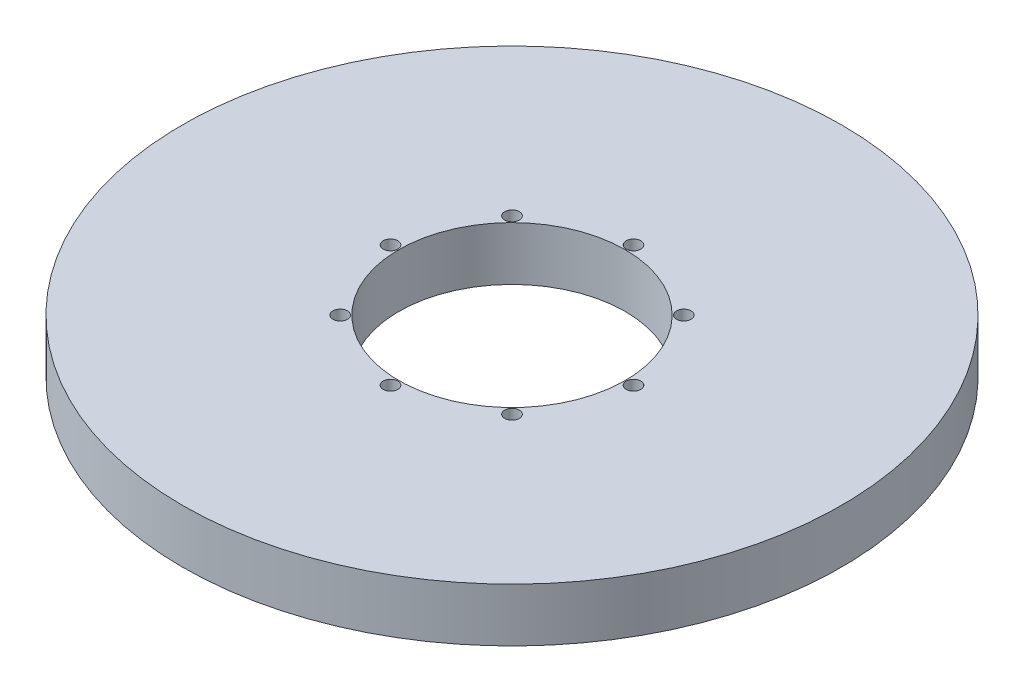
ISO-10303-21;
HEADER;
FILE_DESCRIPTION(('STEP AP214'),'2;1');
FILE_NAME('part.step','',(''),(''),'','','');
FILE_SCHEMA(('AUTOMOTIVE_DESIGN { 1 0 10303 214 1 1 1 1 }'));
ENDSEC;
DATA;
#1=APPLICATION_CONTEXT('core data for automotive mechanical design processes');
#2=APPLICATION_PROTOCOL_DEFINITION('international standard','automotive_design',2000,#1);
#3=PRODUCT_CONTEXT('',#1,'mechanical');
#4=PRODUCT('Part','Part','',(#3));
#5=PRODUCT_RELATED_PRODUCT_CATEGORY('part','',(#4));
#6=PRODUCT_DEFINITION_FORMATION('','',#4);
#7=PRODUCT_DEFINITION_CONTEXT('part definition',#1,'design');
#8=PRODUCT_DEFINITION('design','',#6,#7);
#9=PRODUCT_DEFINITION_SHAPE('','',#8);
#10=(LENGTH_UNIT() NAMED_UNIT(*) SI_UNIT(.MILLI.,.METRE.));
#11=(NAMED_UNIT(*) PLANE_ANGLE_UNIT() SI_UNIT($,.RADIAN.));
#12=(NAMED_UNIT(*) SI_UNIT($,.STERADIAN.) SOLID_ANGLE_UNIT());
#13=UNCERTAINTY_MEASURE_WITH_UNIT(LENGTH_MEASURE(1.E-05),#10,'distance_accuracy_value','');
#14=(GEOMETRIC_REPRESENTATION_CONTEXT(3) GLOBAL_UNCERTAINTY_ASSIGNED_CONTEXT((#13)) GLOBAL_UNIT_ASSIGNED_CONTEXT((#10,
#11,#12)) REPRESENTATION_CONTEXT('',''));
#15=CARTESIAN_POINT('',(0.,0.,0.));
#16=DIRECTION('',(0.,0.,1.));
#17=DIRECTION('',(1.,0.,0.));
#18=AXIS2_PLACEMENT_3D('',#15,#16,#17);
#19=CARTESIAN_POINT('',(0.,13.,0.));
#20=DIRECTION('',(0.,-1.,0.));
#21=DIRECTION('',(0.,0.,-1.));
#22=AXIS2_PLACEMENT_3D('',#19,#20,#21);
#23=CYLINDRICAL_SURFACE('',#22,80.);
#24=CARTESIAN_POINT('',(0.,13.,0.));
#25=DIRECTION('',(0.,1.,0.));
#26=DIRECTION('',(0.,0.,1.));
#27=AXIS2_PLACEMENT_3D('',#24,#25,#26);
#28=CIRCLE('',#27,80.);
#29=CARTESIAN_POINT('',(0.,13.,-80.));
#30=VERTEX_POINT('',#29);
#31=EDGE_CURVE('E10',#30,#30,#28,.T.);
#32=CARTESIAN_POINT('',(0.,0.,0.));
#33=DIRECTION('',(0.,1.,0.));
#34=DIRECTION('',(0.,0.,1.));
#35=AXIS2_PLACEMENT_3D('',#32,#33,#34);
#36=CIRCLE('',#35,80.);
#37=CARTESIAN_POINT('',(0.,0.,-80.));
#38=VERTEX_POINT('',#37);
#39=EDGE_CURVE('E37',#38,#38,#36,.T.);
#40=CARTESIAN_POINT('',(0.,13.,-80.));
#41=CARTESIAN_POINT('',(0.,12.8645833333333,-80.));
#42=CARTESIAN_POINT('',(0.,12.7291666666667,-80.));
#43=CARTESIAN_POINT('',(0.,12.4583333333333,-80.));
#44=CARTESIAN_POINT('',(0.,12.3229166666667,-80.));
#45=CARTESIAN_POINT('',(0.,12.0520833333333,-80.));
#46=CARTESIAN_POINT('',(0.,11.9166666666667,-80.));
#47=CARTESIAN_POINT('',(0.,11.6458333333333,-80.));
#48=CARTESIAN_POINT('',(0.,11.5104166666667,-80.));
#49=CARTESIAN_POINT('',(0.,11.2395833333333,-80.));
#50=CARTESIAN_POINT('',(0.,11.1041666666667,-80.));
#51=CARTESIAN_POINT('',(0.,10.8333333333333,-80.));
#52=CARTESIAN_POINT('',(0.,10.6979166666667,-80.));
#53=CARTESIAN_POINT('',(0.,10.4270833333333,-80.));
#54=CARTESIAN_POINT('',(0.,10.2916666666667,-80.));
#55=CARTESIAN_POINT('',(0.,10.0208333333333,-80.));
#56=CARTESIAN_POINT('',(0.,9.88541666666667,-80.));
#57=CARTESIAN_POINT('',(0.,9.61458333333333,-80.));
#58=CARTESIAN_POINT('',(0.,9.47916666666667,-80.));
#59=CARTESIAN_POINT('',(0.,9.20833333333333,-80.));
#60=CARTESIAN_POINT('',(0.,9.07291666666667,-80.));
#61=CARTESIAN_POINT('',(0.,8.80208333333333,-80.));
#62=CARTESIAN_POINT('',(0.,8.66666666666667,-80.));
#63=CARTESIAN_POINT('',(0.,8.39583333333333,-80.));
#64=CARTESIAN_POINT('',(0.,8.26041666666667,-80.));
#65=CARTESIAN_POINT('',(0.,7.98958333333333,-80.));
#66=CARTESIAN_POINT('',(0.,7.85416666666667,-80.));
#67=CARTESIAN_POINT('',(0.,7.58333333333333,-80.));
#68=CARTESIAN_POINT('',(0.,7.44791666666667,-80.));
#69=CARTESIAN_POINT('',(0.,7.17708333333333,-80.));
#70=CARTESIAN_POINT('',(0.,7.04166666666667,-80.));
#71=CARTESIAN_POINT('',(0.,6.77083333333333,-80.));
#72=CARTESIAN_POINT('',(0.,6.63541666666667,-80.));
#73=CARTESIAN_POINT('',(0.,6.36458333333333,-80.));
#74=CARTESIAN_POINT('',(0.,6.22916666666667,-80.));
#75=CARTESIAN_POINT('',(0.,5.95833333333333,-80.));
#76=CARTESIAN_POINT('',(0.,5.82291666666667,-80.));
#77=CARTESIAN_POINT('',(0.,5.55208333333333,-80.));
#78=CARTESIAN_POINT('',(0.,5.41666666666667,-80.));
#79=CARTESIAN_POINT('',(0.,5.14583333333333,-80.));
#80=CARTESIAN_POINT('',(0.,5.01041666666667,-80.));
#81=CARTESIAN_POINT('',(0.,4.73958333333333,-80.));
#82=CARTESIAN_POINT('',(0.,4.60416666666667,-80.));
#83=CARTESIAN_POINT('',(0.,4.33333333333333,-80.));
#84=CARTESIAN_POINT('',(0.,4.19791666666667,-80.));
#85=CARTESIAN_POINT('',(0.,3.92708333333333,-80.));
#86=CARTESIAN_POINT('',(0.,3.79166666666667,-80.));
#87=CARTESIAN_POINT('',(0.,3.52083333333333,-80.));
#88=CARTESIAN_POINT('',(0.,3.38541666666667,-80.));
#89=CARTESIAN_POINT('',(0.,3.11458333333333,-80.));
#90=CARTESIAN_POINT('',(0.,2.97916666666667,-80.));
#91=CARTESIAN_POINT('',(0.,2.70833333333333,-80.));
#92=CARTESIAN_POINT('',(0.,2.57291666666667,-80.));
#93=CARTESIAN_POINT('',(0.,2.30208333333333,-80.));
#94=CARTESIAN_POINT('',(0.,2.16666666666667,-80.));
#95=CARTESIAN_POINT('',(0.,1.89583333333333,-80.));
#96=CARTESIAN_POINT('',(0.,1.76041666666667,-80.));
#97=CARTESIAN_POINT('',(0.,1.48958333333333,-80.));
#98=CARTESIAN_POINT('',(0.,1.35416666666667,-80.));
#99=CARTESIAN_POINT('',(0.,1.08333333333333,-80.));
#100=CARTESIAN_POINT('',(0.,0.947916666666667,-80.));
#101=CARTESIAN_POINT('',(0.,0.677083333333334,-80.));
#102=CARTESIAN_POINT('',(0.,0.541666666666667,-80.));
#103=CARTESIAN_POINT('',(0.,0.270833333333334,-80.));
#104=CARTESIAN_POINT('',(0.,0.135416666666667,-80.));
#105=CARTESIAN_POINT('',(0.,0.,-80.));
#106=B_SPLINE_CURVE_WITH_KNOTS('',3,(#40,#41,#42,#43,#44,#45,#46,#47,#48,#49,#50,#51,#52,#53,
#54,#55,#56,#57,#58,#59,#60,#61,#62,#63,#64,#65,#66,#67,#68,#69,#70,#71,#72,#73,#74,#75,#76,#77,
#78,#79,#80,#81,#82,#83,#84,#85,#86,#87,#88,#89,#90,#91,#92,#93,#94,#95,#96,#97,#98,#99,#100,
#101,#102,#103,#104,#105),.UNSPECIFIED.,.F.,.F.,(4,2,2,2,2,2,2,2,2,2,2,2,2,2,2,2,2,2,2,2,2,2,2,
2,2,2,2,2,2,2,2,2,4),(0.,0.406249999999999,0.812499999999999,1.21875,1.625,2.03125,2.4375,
2.84375,3.25,3.65625,4.0625,4.46875,4.875,5.28125,5.6875,6.09375,6.5,6.90625,7.3125,7.71875,
8.125,8.53125,8.9375,9.34375,9.75,10.15625,10.5625,10.96875,11.375,11.78125,12.1875,12.59375,
13.),.UNSPECIFIED.);
#107=EDGE_CURVE('BSEAM40',#30,#38,#106,.T.);
#108=ORIENTED_EDGE('',*,*,#31,.F.);
#109=ORIENTED_EDGE('',*,*,#39,.T.);
#110=ORIENTED_EDGE('',*,*,#107,.T.);
#111=ORIENTED_EDGE('',*,*,#107,.F.);
#112=EDGE_LOOP('',(#108,#110,#109,#111));
#113=FACE_BOUND('',#112,.T.);
#114=ADVANCED_FACE('F40',(#113),#23,.T.);
#115=CARTESIAN_POINT('',(0.,13.,0.));
#116=DIRECTION('',(0.,1.,0.));
#117=DIRECTION('',(0.,0.,1.));
#118=AXIS2_PLACEMENT_3D('',#115,#116,#117);
#119=PLANE('',#118);
#120=CARTESIAN_POINT('',(1.0297203090917E-13,13.,29.4923618131921));
#121=DIRECTION('',(0.,1.,0.));
#122=DIRECTION('',(1.,0.,0.));
#123=AXIS2_PLACEMENT_3D('',#120,#121,#122);
#124=CIRCLE('',#123,1.77324001039528);
#125=CARTESIAN_POINT('',(1.77324001039539,13.,29.492361813192));
#126=VERTEX_POINT('',#125);
#127=EDGE_CURVE('E88',#126,#126,#124,.T.);
#128=ORIENTED_EDGE('',*,*,#127,.F.);
#129=EDGE_LOOP('',(#128));
#130=FACE_BOUND('',#129,.T.);
#131=CARTESIAN_POINT('',(20.8542490313154,13.,20.8542490313152));
#132=DIRECTION('',(0.,1.,0.));
#133=DIRECTION('',(0.707106781186544,0.,-0.707106781186551));
#134=AXIS2_PLACEMENT_3D('',#131,#132,#133);
#135=CIRCLE('',#134,1.77324001039528);
#136=CARTESIAN_POINT('',(22.1081190673372,13.,19.6003789952934));
#137=VERTEX_POINT('',#136);
#138=EDGE_CURVE('E79',#137,#137,#135,.T.);
#139=ORIENTED_EDGE('',*,*,#138,.F.);
#140=EDGE_LOOP('',(#139));
#141=FACE_BOUND('',#140,.T.);
#142=CARTESIAN_POINT('',(29.4923618131921,13.,0.));
#143=DIRECTION('',(0.,1.,0.));
#144=DIRECTION('',(0.,0.,-1.));
#145=AXIS2_PLACEMENT_3D('',#142,#143,#144);
#146=CIRCLE('',#145,1.77324001039528);
#147=CARTESIAN_POINT('',(29.4923618131921,13.,-1.77324001039528));
#148=VERTEX_POINT('',#147);
#149=EDGE_CURVE('E74',#148,#148,#146,.T.);
#150=ORIENTED_EDGE('',*,*,#149,.F.);
#151=EDGE_LOOP('',(#150));
#152=FACE_BOUND('',#151,.T.);
#153=CARTESIAN_POINT('',(20.8542490313151,13.,-20.8542490313155));
#154=DIRECTION('',(0.,1.,0.));
#155=DIRECTION('',(-0.707106781186554,0.,-0.707106781186541));
#156=AXIS2_PLACEMENT_3D('',#153,#154,#155);
#157=CIRCLE('',#156,1.77324001039528);
#158=CARTESIAN_POINT('',(19.6003789952933,13.,-22.1081190673373));
#159=VERTEX_POINT('',#158);
#160=EDGE_CURVE('E70',#159,#159,#157,.T.);
#161=ORIENTED_EDGE('',*,*,#160,.F.);
#162=EDGE_LOOP('',(#161));
#163=FACE_BOUND('',#162,.T.);
#164=CARTESIAN_POINT('',(-3.0891609272751E-13,13.,-29.4923618131921));
#165=DIRECTION('',(0.,1.,0.));
#166=DIRECTION('',(-1.,0.,0.));
#167=AXIS2_PLACEMENT_3D('',#164,#165,#166);
#168=CIRCLE('',#167,1.77324001039528);
#169=CARTESIAN_POINT('',(-1.77324001039559,13.,-29.492361813192));
#170=VERTEX_POINT('',#169);
#171=EDGE_CURVE('E100',#170,#170,#168,.T.);
#172=ORIENTED_EDGE('',*,*,#171,.F.);
#173=EDGE_LOOP('',(#172));
#174=FACE_BOUND('',#173,.T.);
#175=CARTESIAN_POINT('',(-20.8542490313155,13.,-20.854249031315));
#176=DIRECTION('',(0.,1.,0.));
#177=DIRECTION('',(-0.707106781186539,0.,0.707106781186556));
#178=AXIS2_PLACEMENT_3D('',#175,#176,#177);
#179=CIRCLE('',#178,1.77324001039528);
#180=CARTESIAN_POINT('',(-22.1081190673373,13.,-19.6003789952932));
#181=VERTEX_POINT('',#180);
#182=EDGE_CURVE('E93',#181,#181,#179,.T.);
#183=ORIENTED_EDGE('',*,*,#182,.F.);
#184=EDGE_LOOP('',(#183));
#185=FACE_BOUND('',#184,.T.);
#186=CARTESIAN_POINT('',(-20.8542490313152,13.,20.8542490313153));
#187=DIRECTION('',(0.,1.,0.));
#188=DIRECTION('',(0.707106781186549,0.,0.707106781186546));
#189=AXIS2_PLACEMENT_3D('',#186,#187,#188);
#190=CIRCLE('',#189,1.77324001039528);
#191=CARTESIAN_POINT('',(-19.6003789952934,13.,22.1081190673371));
#192=VERTEX_POINT('',#191);
#193=EDGE_CURVE('E61',#192,#192,#190,.T.);
#194=ORIENTED_EDGE('',*,*,#193,.F.);
#195=EDGE_LOOP('',(#194));
#196=FACE_BOUND('',#195,.T.);
#197=CARTESIAN_POINT('',(-29.4923618131921,13.,0.));
#198=DIRECTION('',(0.,1.,0.));
#199=DIRECTION('',(0.,0.,1.));
#200=AXIS2_PLACEMENT_3D('',#197,#198,#199);
#201=CIRCLE('',#200,1.77324001039528);
#202=CARTESIAN_POINT('',(-29.4923618131921,13.,1.77324001039528));
#203=VERTEX_POINT('',#202);
#204=EDGE_CURVE('E54',#203,#203,#201,.T.);
#205=ORIENTED_EDGE('',*,*,#204,.F.);
#206=EDGE_LOOP('',(#205));
#207=FACE_BOUND('',#206,.T.);
#208=CARTESIAN_POINT('',(0.,13.,0.));
#209=DIRECTION('',(0.,1.,0.));
#210=DIRECTION('',(0.,0.,1.));
#211=AXIS2_PLACEMENT_3D('',#208,#209,#210);
#212=CIRCLE('',#211,27.5);
#213=CARTESIAN_POINT('',(0.,13.,-27.5));
#214=VERTEX_POINT('',#213);
#215=EDGE_CURVE('E50',#214,#214,#212,.T.);
#216=ORIENTED_EDGE('',*,*,#215,.F.);
#217=EDGE_LOOP('',(#216));
#218=FACE_BOUND('',#217,.T.);
#219=ORIENTED_EDGE('',*,*,#31,.T.);
#220=EDGE_LOOP('',(#219));
#221=FACE_BOUND('',#220,.T.);
#222=ADVANCED_FACE('F115',(#130,#141,#152,#163,#174,#185,#196,#207,#218,#221),#119,.T.);
#223=CARTESIAN_POINT('',(0.,0.,0.));
#224=DIRECTION('',(0.,1.,0.));
#225=DIRECTION('',(0.,0.,1.));
#226=AXIS2_PLACEMENT_3D('',#223,#224,#225);
#227=PLANE('',#226);
#228=CARTESIAN_POINT('',(0.,0.,0.));
#229=DIRECTION('',(0.,1.,0.));
#230=DIRECTION('',(0.,0.,1.));
#231=AXIS2_PLACEMENT_3D('',#228,#229,#230);
#232=CIRCLE('',#231,27.5);
#233=CARTESIAN_POINT('',(0.,0.,-27.5));
#234=VERTEX_POINT('',#233);
#235=EDGE_CURVE('E47',#234,#234,#232,.T.);
#236=ORIENTED_EDGE('',*,*,#235,.T.);
#237=EDGE_LOOP('',(#236));
#238=FACE_BOUND('',#237,.T.);
#239=ORIENTED_EDGE('',*,*,#39,.F.);
#240=EDGE_LOOP('',(#239));
#241=FACE_BOUND('',#240,.T.);
#242=ADVANCED_FACE('F113',(#238,#241),#227,.F.);
#243=CARTESIAN_POINT('',(0.,13.,0.));
#244=DIRECTION('',(0.,-1.,0.));
#245=DIRECTION('',(0.,0.,-1.));
#246=AXIS2_PLACEMENT_3D('',#243,#244,#245);
#247=CYLINDRICAL_SURFACE('',#246,27.5);
#248=CARTESIAN_POINT('',(0.,13.,-27.5));
#249=CARTESIAN_POINT('',(0.,12.8645833333333,-27.5));
#250=CARTESIAN_POINT('',(0.,12.7291666666667,-27.5));
#251=CARTESIAN_POINT('',(0.,12.4583333333333,-27.5));
#252=CARTESIAN_POINT('',(0.,12.3229166666667,-27.5));
#253=CARTESIAN_POINT('',(0.,12.0520833333333,-27.5));
#254=CARTESIAN_POINT('',(0.,11.9166666666667,-27.5));
#255=CARTESIAN_POINT('',(0.,11.6458333333333,-27.5));
#256=CARTESIAN_POINT('',(0.,11.5104166666667,-27.5));
#257=CARTESIAN_POINT('',(0.,11.2395833333333,-27.5));
#258=CARTESIAN_POINT('',(0.,11.1041666666667,-27.5));
#259=CARTESIAN_POINT('',(0.,10.8333333333333,-27.5));
#260=CARTESIAN_POINT('',(0.,10.6979166666667,-27.5));
#261=CARTESIAN_POINT('',(0.,10.4270833333333,-27.5));
#262=CARTESIAN_POINT('',(0.,10.2916666666667,-27.5));
#263=CARTESIAN_POINT('',(0.,10.0208333333333,-27.5));
#264=CARTESIAN_POINT('',(0.,9.88541666666667,-27.5));
#265=CARTESIAN_POINT('',(0.,9.61458333333333,-27.5));
#266=CARTESIAN_POINT('',(0.,9.47916666666667,-27.5));
#267=CARTESIAN_POINT('',(0.,9.20833333333333,-27.5));
#268=CARTESIAN_POINT('',(0.,9.07291666666666,-27.5));
#269=CARTESIAN_POINT('',(0.,8.80208333333333,-27.5));
#270=CARTESIAN_POINT('',(0.,8.66666666666667,-27.5));
#271=CARTESIAN_POINT('',(0.,8.39583333333333,-27.5));
#272=CARTESIAN_POINT('',(0.,8.26041666666667,-27.5));
#273=CARTESIAN_POINT('',(0.,7.98958333333333,-27.5));
#274=CARTESIAN_POINT('',(0.,7.85416666666667,-27.5));
#275=CARTESIAN_POINT('',(0.,7.58333333333333,-27.5));
#276=CARTESIAN_POINT('',(0.,7.44791666666667,-27.5));
#277=CARTESIAN_POINT('',(0.,7.17708333333333,-27.5));
#278=CARTESIAN_POINT('',(0.,7.04166666666667,-27.5));
#279=CARTESIAN_POINT('',(0.,6.77083333333333,-27.5));
#280=CARTESIAN_POINT('',(0.,6.63541666666667,-27.5));
#281=CARTESIAN_POINT('',(0.,6.36458333333333,-27.5));
#282=CARTESIAN_POINT('',(0.,6.22916666666667,-27.5));
#283=CARTESIAN_POINT('',(0.,5.95833333333333,-27.5));
#284=CARTESIAN_POINT('',(0.,5.82291666666667,-27.5));
#285=CARTESIAN_POINT('',(0.,5.55208333333333,-27.5));
#286=CARTESIAN_POINT('',(0.,5.41666666666667,-27.5));
#287=CARTESIAN_POINT('',(0.,5.14583333333333,-27.5));
#288=CARTESIAN_POINT('',(0.,5.01041666666667,-27.5));
#289=CARTESIAN_POINT('',(0.,4.73958333333333,-27.5));
#290=CARTESIAN_POINT('',(0.,4.60416666666667,-27.5));
#291=CARTESIAN_POINT('',(0.,4.33333333333333,-27.5));
#292=CARTESIAN_POINT('',(0.,4.19791666666667,-27.5));
#293=CARTESIAN_POINT('',(0.,3.92708333333333,-27.5));
#294=CARTESIAN_POINT('',(0.,3.79166666666667,-27.5));
#295=CARTESIAN_POINT('',(0.,3.52083333333333,-27.5));
#296=CARTESIAN_POINT('',(0.,3.38541666666667,-27.5));
#297=CARTESIAN_POINT('',(0.,3.11458333333333,-27.5));
#298=CARTESIAN_POINT('',(0.,2.97916666666667,-27.5));
#299=CARTESIAN_POINT('',(0.,2.70833333333333,-27.5));
#300=CARTESIAN_POINT('',(0.,2.57291666666667,-27.5));
#301=CARTESIAN_POINT('',(0.,2.30208333333333,-27.5));
#302=CARTESIAN_POINT('',(0.,2.16666666666667,-27.5));
#303=CARTESIAN_POINT('',(0.,1.89583333333333,-27.5));
#304=CARTESIAN_POINT('',(0.,1.76041666666667,-27.5));
#305=CARTESIAN_POINT('',(0.,1.48958333333333,-27.5));
#306=CARTESIAN_POINT('',(0.,1.35416666666667,-27.5));
#307=CARTESIAN_POINT('',(0.,1.08333333333333,-27.5));
#308=CARTESIAN_POINT('',(0.,0.947916666666667,-27.5));
#309=CARTESIAN_POINT('',(0.,0.677083333333334,-27.5));
#310=CARTESIAN_POINT('',(0.,0.541666666666667,-27.5));
#311=CARTESIAN_POINT('',(0.,0.270833333333334,-27.5));
#312=CARTESIAN_POINT('',(0.,0.135416666666667,-27.5));
#313=CARTESIAN_POINT('',(0.,0.,-27.5));
#314=B_SPLINE_CURVE_WITH_KNOTS('',3,(#248,#249,#250,#251,#252,#253,#254,#255,#256,#257,#258,
#259,#260,#261,#262,#263,#264,#265,#266,#267,#268,#269,#270,#271,#272,#273,#274,#275,#276,#277,
#278,#279,#280,#281,#282,#283,#284,#285,#286,#287,#288,#289,#290,#291,#292,#293,#294,#295,#296,
#297,#298,#299,#300,#301,#302,#303,#304,#305,#306,#307,#308,#309,#310,#311,#312,#313),
.UNSPECIFIED.,.F.,.F.,(4,2,2,2,2,2,2,2,2,2,2,2,2,2,2,2,2,2,2,2,2,2,2,2,2,2,2,2,2,2,2,2,4),(0.,
0.40625,0.812500000000001,1.21875,1.625,2.03125,2.4375,2.84375,3.25,3.65625,4.0625,4.46875,
4.875,5.28125,5.6875,6.09375,6.5,6.90625,7.3125,7.71875,8.125,8.53125,8.9375,9.34375,9.75,
10.15625,10.5625,10.96875,11.375,11.78125,12.1875,12.59375,13.),.UNSPECIFIED.);
#315=EDGE_CURVE('BSEAM127',#214,#234,#314,.T.);
#316=ORIENTED_EDGE('',*,*,#215,.T.);
#317=ORIENTED_EDGE('',*,*,#235,.F.);
#318=ORIENTED_EDGE('',*,*,#315,.T.);
#319=ORIENTED_EDGE('',*,*,#315,.F.);
#320=EDGE_LOOP('',(#316,#318,#317,#319));
#321=FACE_BOUND('',#320,.T.);
#322=ADVANCED_FACE('F127',(#321),#247,.F.);
#323=CARTESIAN_POINT('',(-29.4923618131921,0.255902499465811,0.));
#324=DIRECTION('',(0.,1.,0.));
#325=DIRECTION('',(0.,0.,1.));
#326=AXIS2_PLACEMENT_3D('',#323,#324,#325);
#327=CYLINDRICAL_SURFACE('',#326,1.77324001039528);
#328=CARTESIAN_POINT('',(-29.4923618131921,0.255902499465811,0.));
#329=DIRECTION('',(0.,1.,0.));
#330=DIRECTION('',(0.,0.,1.));
#331=AXIS2_PLACEMENT_3D('',#328,#329,#330);
#332=CIRCLE('',#331,1.77324001039528);
#333=CARTESIAN_POINT('',(-29.4923618131921,0.255902499465811,1.77324001039528));
#334=VERTEX_POINT('',#333);
#335=EDGE_CURVE('E55',#334,#334,#332,.T.);
#336=ORIENTED_EDGE('',*,*,#335,.F.);
#337=EDGE_LOOP('',(#336));
#338=FACE_BOUND('',#337,.T.);
#339=ORIENTED_EDGE('',*,*,#204,.T.);
#340=EDGE_LOOP('',(#339));
#341=FACE_BOUND('',#340,.T.);
#342=ADVANCED_FACE('F129',(#338,#341),#327,.F.);
#343=CARTESIAN_POINT('',(-29.4923618131921,0.255902499465811,0.));
#344=DIRECTION('',(0.,1.,0.));
#345=DIRECTION('',(0.,0.,1.));
#346=AXIS2_PLACEMENT_3D('',#343,#344,#345);
#347=PLANE('',#346);
#348=ORIENTED_EDGE('',*,*,#335,.T.);
#349=EDGE_LOOP('',(#348));
#350=FACE_BOUND('',#349,.T.);
#351=ADVANCED_FACE('F157',(#350),#347,.T.);
#352=CARTESIAN_POINT('',(-20.8542490313152,0.255902499465811,20.8542490313153));
#353=DIRECTION('',(0.,1.,0.));
#354=DIRECTION('',(0.,0.,1.));
#355=AXIS2_PLACEMENT_3D('',#352,#353,#354);
#356=CYLINDRICAL_SURFACE('',#355,1.77324001039528);
#357=CARTESIAN_POINT('',(-20.8542490313152,0.255902499465811,20.8542490313153));
#358=DIRECTION('',(0.,1.,0.));
#359=DIRECTION('',(0.707106781186549,0.,0.707106781186546));
#360=AXIS2_PLACEMENT_3D('',#357,#358,#359);
#361=CIRCLE('',#360,1.77324001039528);
#362=CARTESIAN_POINT('',(-19.6003789952934,0.255902499465811,22.1081190673371));
#363=VERTEX_POINT('',#362);
#364=EDGE_CURVE('E59',#363,#363,#361,.T.);
#365=ORIENTED_EDGE('',*,*,#364,.F.);
#366=EDGE_LOOP('',(#365));
#367=FACE_BOUND('',#366,.T.);
#368=ORIENTED_EDGE('',*,*,#193,.T.);
#369=EDGE_LOOP('',(#368));
#370=FACE_BOUND('',#369,.T.);
#371=ADVANCED_FACE('F170',(#367,#370),#356,.F.);
#372=CARTESIAN_POINT('',(-20.8542490313152,0.255902499465811,20.8542490313153));
#373=DIRECTION('',(0.,1.,0.));
#374=DIRECTION('',(0.707106781186549,0.,0.707106781186546));
#375=AXIS2_PLACEMENT_3D('',#372,#373,#374);
#376=PLANE('',#375);
#377=ORIENTED_EDGE('',*,*,#364,.T.);
#378=EDGE_LOOP('',(#377));
#379=FACE_BOUND('',#378,.T.);
#380=ADVANCED_FACE('F182',(#379),#376,.T.);
#381=CARTESIAN_POINT('',(-20.8542490313155,0.255902499465811,-20.854249031315));
#382=DIRECTION('',(0.,1.,0.));
#383=DIRECTION('',(0.,0.,1.));
#384=AXIS2_PLACEMENT_3D('',#381,#382,#383);
#385=CYLINDRICAL_SURFACE('',#384,1.77324001039528);
#386=CARTESIAN_POINT('',(-20.8542490313155,0.255902499465811,-20.854249031315));
#387=DIRECTION('',(0.,1.,0.));
#388=DIRECTION('',(-0.707106781186539,0.,0.707106781186556));
#389=AXIS2_PLACEMENT_3D('',#386,#387,#388);
#390=CIRCLE('',#389,1.77324001039528);
#391=CARTESIAN_POINT('',(-22.1081190673373,0.255902499465811,-19.6003789952932));
#392=VERTEX_POINT('',#391);
#393=EDGE_CURVE('E94',#392,#392,#390,.T.);
#394=ORIENTED_EDGE('',*,*,#393,.F.);
#395=EDGE_LOOP('',(#394));
#396=FACE_BOUND('',#395,.T.);
#397=ORIENTED_EDGE('',*,*,#182,.T.);
#398=EDGE_LOOP('',(#397));
#399=FACE_BOUND('',#398,.T.);
#400=ADVANCED_FACE('F189',(#396,#399),#385,.F.);
#401=CARTESIAN_POINT('',(-20.8542490313155,0.255902499465811,-20.854249031315));
#402=DIRECTION('',(0.,1.,0.));
#403=DIRECTION('',(-0.707106781186539,0.,0.707106781186556));
#404=AXIS2_PLACEMENT_3D('',#401,#402,#403);
#405=PLANE('',#404);
#406=ORIENTED_EDGE('',*,*,#393,.T.);
#407=EDGE_LOOP('',(#406));
#408=FACE_BOUND('',#407,.T.);
#409=ADVANCED_FACE('F107',(#408),#405,.T.);
#410=CARTESIAN_POINT('',(-3.0891609272751E-13,0.255902499465811,-29.4923618131921));
#411=DIRECTION('',(0.,1.,0.));
#412=DIRECTION('',(0.,0.,1.));
#413=AXIS2_PLACEMENT_3D('',#410,#411,#412);
#414=CYLINDRICAL_SURFACE('',#413,1.77324001039528);
#415=CARTESIAN_POINT('',(-3.0891609272751E-13,0.255902499465811,-29.4923618131921));
#416=DIRECTION('',(0.,1.,0.));
#417=DIRECTION('',(-1.,0.,0.));
#418=AXIS2_PLACEMENT_3D('',#415,#416,#417);
#419=CIRCLE('',#418,1.77324001039528);
#420=CARTESIAN_POINT('',(-1.77324001039559,0.255902499465811,-29.492361813192));
#421=VERTEX_POINT('',#420);
#422=EDGE_CURVE('E72',#421,#421,#419,.T.);
#423=ORIENTED_EDGE('',*,*,#422,.F.);
#424=EDGE_LOOP('',(#423));
#425=FACE_BOUND('',#424,.T.);
#426=ORIENTED_EDGE('',*,*,#171,.T.);
#427=EDGE_LOOP('',(#426));
#428=FACE_BOUND('',#427,.T.);
#429=ADVANCED_FACE('F104',(#425,#428),#414,.F.);
#430=CARTESIAN_POINT('',(-3.0891609272751E-13,0.255902499465811,-29.4923618131921));
#431=DIRECTION('',(0.,1.,0.));
#432=DIRECTION('',(-1.,0.,0.));
#433=AXIS2_PLACEMENT_3D('',#430,#431,#432);
#434=PLANE('',#433);
#435=ORIENTED_EDGE('',*,*,#422,.T.);
#436=EDGE_LOOP('',(#435));
#437=FACE_BOUND('',#436,.T.);
#438=ADVANCED_FACE('F103',(#437),#434,.T.);
#439=CARTESIAN_POINT('',(20.8542490313151,0.255902499465811,-20.8542490313155));
#440=DIRECTION('',(0.,1.,0.));
#441=DIRECTION('',(0.,0.,1.));
#442=AXIS2_PLACEMENT_3D('',#439,#440,#441);
#443=CYLINDRICAL_SURFACE('',#442,1.77324001039528);
#444=CARTESIAN_POINT('',(20.8542490313151,0.255902499465811,-20.8542490313155));
#445=DIRECTION('',(0.,1.,0.));
#446=DIRECTION('',(-0.707106781186554,0.,-0.707106781186541));
#447=AXIS2_PLACEMENT_3D('',#444,#445,#446);
#448=CIRCLE('',#447,1.77324001039528);
#449=CARTESIAN_POINT('',(19.6003789952933,0.255902499465811,-22.1081190673373));
#450=VERTEX_POINT('',#449);
#451=EDGE_CURVE('E69',#450,#450,#448,.T.);
#452=ORIENTED_EDGE('',*,*,#451,.F.);
#453=EDGE_LOOP('',(#452));
#454=FACE_BOUND('',#453,.T.);
#455=ORIENTED_EDGE('',*,*,#160,.T.);
#456=EDGE_LOOP('',(#455));
#457=FACE_BOUND('',#456,.T.);
#458=ADVANCED_FACE('F219',(#454,#457),#443,.F.);
#459=CARTESIAN_POINT('',(20.8542490313151,0.255902499465811,-20.8542490313155));
#460=DIRECTION('',(0.,1.,0.));
#461=DIRECTION('',(-0.707106781186554,0.,-0.707106781186541));
#462=AXIS2_PLACEMENT_3D('',#459,#460,#461);
#463=PLANE('',#462);
#464=ORIENTED_EDGE('',*,*,#451,.T.);
#465=EDGE_LOOP('',(#464));
#466=FACE_BOUND('',#465,.T.);
#467=ADVANCED_FACE('F227',(#466),#463,.T.);
#468=CARTESIAN_POINT('',(29.4923618131921,0.255902499465811,0.));
#469=DIRECTION('',(0.,1.,0.));
#470=DIRECTION('',(0.,0.,1.));
#471=AXIS2_PLACEMENT_3D('',#468,#469,#470);
#472=CYLINDRICAL_SURFACE('',#471,1.77324001039528);
#473=CARTESIAN_POINT('',(29.4923618131921,0.255902499465811,0.));
#474=DIRECTION('',(0.,1.,0.));
#475=DIRECTION('',(0.,0.,-1.));
#476=AXIS2_PLACEMENT_3D('',#473,#474,#475);
#477=CIRCLE('',#476,1.77324001039528);
#478=CARTESIAN_POINT('',(29.4923618131921,0.255902499465811,-1.77324001039528));
#479=VERTEX_POINT('',#478);
#480=EDGE_CURVE('E80',#479,#479,#477,.T.);
#481=ORIENTED_EDGE('',*,*,#480,.F.);
#482=EDGE_LOOP('',(#481));
#483=FACE_BOUND('',#482,.T.);
#484=ORIENTED_EDGE('',*,*,#149,.T.);
#485=EDGE_LOOP('',(#484));
#486=FACE_BOUND('',#485,.T.);
#487=ADVANCED_FACE('F240',(#483,#486),#472,.F.);
#488=CARTESIAN_POINT('',(29.4923618131921,0.255902499465811,0.));
#489=DIRECTION('',(0.,1.,0.));
#490=DIRECTION('',(0.,0.,-1.));
#491=AXIS2_PLACEMENT_3D('',#488,#489,#490);
#492=PLANE('',#491);
#493=ORIENTED_EDGE('',*,*,#480,.T.);
#494=EDGE_LOOP('',(#493));
#495=FACE_BOUND('',#494,.T.);
#496=ADVANCED_FACE('F246',(#495),#492,.T.);
#497=CARTESIAN_POINT('',(20.8542490313154,0.255902499465811,20.8542490313152));
#498=DIRECTION('',(0.,1.,0.));
#499=DIRECTION('',(0.,0.,1.));
#500=AXIS2_PLACEMENT_3D('',#497,#498,#499);
#501=CYLINDRICAL_SURFACE('',#500,1.77324001039528);
#502=CARTESIAN_POINT('',(20.8542490313154,0.255902499465811,20.8542490313152));
#503=DIRECTION('',(0.,1.,0.));
#504=DIRECTION('',(0.707106781186544,0.,-0.707106781186551));
#505=AXIS2_PLACEMENT_3D('',#502,#503,#504);
#506=CIRCLE('',#505,1.77324001039528);
#507=CARTESIAN_POINT('',(22.1081190673372,0.255902499465811,19.6003789952934));
#508=VERTEX_POINT('',#507);
#509=EDGE_CURVE('E82',#508,#508,#506,.T.);
#510=ORIENTED_EDGE('',*,*,#509,.F.);
#511=EDGE_LOOP('',(#510));
#512=FACE_BOUND('',#511,.T.);
#513=ORIENTED_EDGE('',*,*,#138,.T.);
#514=EDGE_LOOP('',(#513));
#515=FACE_BOUND('',#514,.T.);
#516=ADVANCED_FACE('F254',(#512,#515),#501,.F.);
#517=CARTESIAN_POINT('',(20.8542490313154,0.255902499465811,20.8542490313152));
#518=DIRECTION('',(0.,1.,0.));
#519=DIRECTION('',(0.707106781186544,0.,-0.707106781186551));
#520=AXIS2_PLACEMENT_3D('',#517,#518,#519);
#521=PLANE('',#520);
#522=ORIENTED_EDGE('',*,*,#509,.T.);
#523=EDGE_LOOP('',(#522));
#524=FACE_BOUND('',#523,.T.);
#525=ADVANCED_FACE('F262',(#524),#521,.T.);
#526=CARTESIAN_POINT('',(1.0297203090917E-13,0.255902499465811,29.4923618131921));
#527=DIRECTION('',(0.,1.,0.));
#528=DIRECTION('',(0.,0.,1.));
#529=AXIS2_PLACEMENT_3D('',#526,#527,#528);
#530=CYLINDRICAL_SURFACE('',#529,1.77324001039528);
#531=CARTESIAN_POINT('',(1.0297203090917E-13,0.255902499465811,29.4923618131921));
#532=DIRECTION('',(0.,1.,0.));
#533=DIRECTION('',(1.,0.,0.));
#534=AXIS2_PLACEMENT_3D('',#531,#532,#533);
#535=CIRCLE('',#534,1.77324001039528);
#536=CARTESIAN_POINT('',(1.77324001039539,0.255902499465811,29.492361813192));
#537=VERTEX_POINT('',#536);
#538=EDGE_CURVE('E63',#537,#537,#535,.T.);
#539=ORIENTED_EDGE('',*,*,#538,.F.);
#540=EDGE_LOOP('',(#539));
#541=FACE_BOUND('',#540,.T.);
#542=ORIENTED_EDGE('',*,*,#127,.T.);
#543=EDGE_LOOP('',(#542));
#544=FACE_BOUND('',#543,.T.);
#545=ADVANCED_FACE('F272',(#541,#544),#530,.F.);
#546=CARTESIAN_POINT('',(1.0297203090917E-13,0.255902499465811,29.4923618131921));
#547=DIRECTION('',(0.,1.,0.));
#548=DIRECTION('',(1.,0.,0.));
#549=AXIS2_PLACEMENT_3D('',#546,#547,#548);
#550=PLANE('',#549);
#551=ORIENTED_EDGE('',*,*,#538,.T.);
#552=EDGE_LOOP('',(#551));
#553=FACE_BOUND('',#552,.T.);
#554=ADVANCED_FACE('F285',(#553),#550,.T.);
#555=CLOSED_SHELL('',(#114,#222,#242,#322,#342,#351,#371,#380,#400,#409,#429,#438,#458,#467,
#487,#496,#516,#525,#545,#554));
#556=MANIFOLD_SOLID_BREP('B2',#555);
#557=ADVANCED_BREP_SHAPE_REPRESENTATION('',(#18,#556),#14);
#558=SHAPE_DEFINITION_REPRESENTATION(#9,#557);
ENDSEC;
END-ISO-10303-21;
